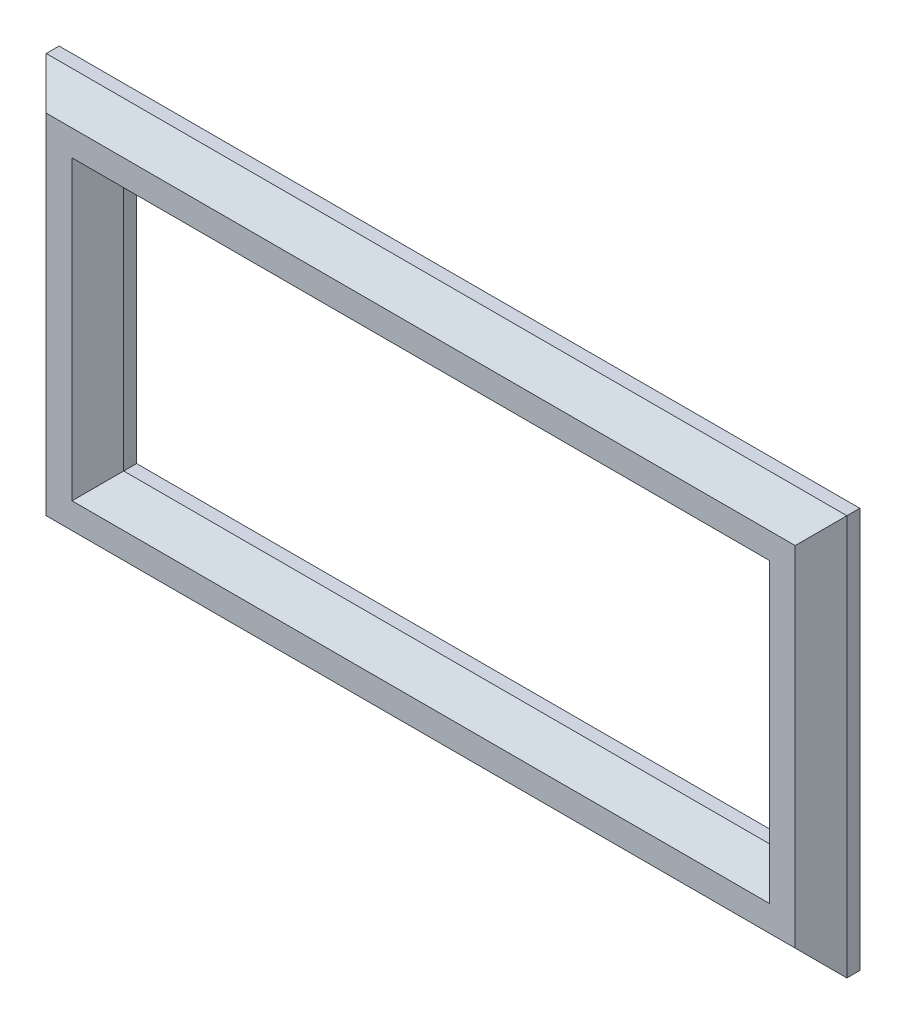
ISO-10303-21;
HEADER;
FILE_DESCRIPTION(('STEP AP214'),'2;1');
FILE_NAME('part.step','',(''),(''),'','','');
FILE_SCHEMA(('AUTOMOTIVE_DESIGN { 1 0 10303 214 1 1 1 1 }'));
ENDSEC;
DATA;
#1=APPLICATION_CONTEXT('core data for automotive mechanical design processes');
#2=APPLICATION_PROTOCOL_DEFINITION('international standard','automotive_design',2000,#1);
#3=PRODUCT_CONTEXT('',#1,'mechanical');
#4=PRODUCT('Part','Part','',(#3));
#5=PRODUCT_RELATED_PRODUCT_CATEGORY('part','',(#4));
#6=PRODUCT_DEFINITION_FORMATION('','',#4);
#7=PRODUCT_DEFINITION_CONTEXT('part definition',#1,'design');
#8=PRODUCT_DEFINITION('design','',#6,#7);
#9=PRODUCT_DEFINITION_SHAPE('','',#8);
#10=(LENGTH_UNIT() NAMED_UNIT(*) SI_UNIT(.MILLI.,.METRE.));
#11=(NAMED_UNIT(*) PLANE_ANGLE_UNIT() SI_UNIT($,.RADIAN.));
#12=(NAMED_UNIT(*) SI_UNIT($,.STERADIAN.) SOLID_ANGLE_UNIT());
#13=UNCERTAINTY_MEASURE_WITH_UNIT(LENGTH_MEASURE(1.E-05),#10,'distance_accuracy_value','');
#14=(GEOMETRIC_REPRESENTATION_CONTEXT(3) GLOBAL_UNCERTAINTY_ASSIGNED_CONTEXT((#13)) GLOBAL_UNIT_ASSIGNED_CONTEXT((#10,
#11,#12)) REPRESENTATION_CONTEXT('',''));
#15=CARTESIAN_POINT('',(0.,0.,0.));
#16=DIRECTION('',(0.,0.,1.));
#17=DIRECTION('',(1.,0.,0.));
#18=AXIS2_PLACEMENT_3D('',#15,#16,#17);
#19=CARTESIAN_POINT('',(0.,0.,3.));
#20=DIRECTION('',(0.,0.,1.));
#21=DIRECTION('',(1.,0.,0.));
#22=AXIS2_PLACEMENT_3D('',#19,#20,#21);
#23=PLANE('',#22);
#24=DIRECTION('',(-1.,0.,0.));
#25=VECTOR('',#24,1.);
#26=CARTESIAN_POINT('',(0.,-1.99999999999999,3.));
#27=LINE('',#26,#25);
#28=CARTESIAN_POINT('',(1.99999999999999,-1.99999999999999,3.));
#29=VERTEX_POINT('',#28);
#30=CARTESIAN_POINT('',(-52.,-2.,3.));
#31=VERTEX_POINT('',#30);
#32=EDGE_CURVE('E197',#29,#31,#27,.T.);
#33=ORIENTED_EDGE('',*,*,#32,.T.);
#34=DIRECTION('',(0.,1.,0.));
#35=VECTOR('',#34,1.);
#36=CARTESIAN_POINT('',(-52.,0.,3.));
#37=LINE('',#36,#35);
#38=CARTESIAN_POINT('',(-52.,21.,3.));
#39=VERTEX_POINT('',#38);
#40=EDGE_CURVE('E199',#31,#39,#37,.T.);
#41=ORIENTED_EDGE('',*,*,#40,.T.);
#42=DIRECTION('',(1.,0.,0.));
#43=VECTOR('',#42,1.);
#44=CARTESIAN_POINT('',(0.,21.,3.));
#45=LINE('',#44,#43);
#46=CARTESIAN_POINT('',(1.99999999999999,21.,3.));
#47=VERTEX_POINT('',#46);
#48=EDGE_CURVE('E193',#39,#47,#45,.T.);
#49=ORIENTED_EDGE('',*,*,#48,.T.);
#50=DIRECTION('',(0.,-1.,0.));
#51=VECTOR('',#50,1.);
#52=CARTESIAN_POINT('',(1.99999999999999,0.,3.));
#53=LINE('',#52,#51);
#54=EDGE_CURVE('E195',#47,#29,#53,.T.);
#55=ORIENTED_EDGE('',*,*,#54,.T.);
#56=EDGE_LOOP('',(#33,#41,#49,#55));
#57=FACE_BOUND('',#56,.T.);
#58=DIRECTION('',(0.,-1.,0.));
#59=VECTOR('',#58,1.);
#60=CARTESIAN_POINT('',(-54.,-6.,3.));
#61=LINE('',#60,#59);
#62=CARTESIAN_POINT('',(-54.,23.,3.));
#63=VERTEX_POINT('',#62);
#64=CARTESIAN_POINT('',(-54.,-4.,3.));
#65=VERTEX_POINT('',#64);
#66=EDGE_CURVE('E188',#63,#65,#61,.T.);
#67=ORIENTED_EDGE('',*,*,#66,.T.);
#68=DIRECTION('',(1.,0.,0.));
#69=VECTOR('',#68,1.);
#70=CARTESIAN_POINT('',(6.,-4.,3.));
#71=LINE('',#70,#69);
#72=CARTESIAN_POINT('',(4.,-4.,3.));
#73=VERTEX_POINT('',#72);
#74=EDGE_CURVE('E190',#65,#73,#71,.T.);
#75=ORIENTED_EDGE('',*,*,#74,.T.);
#76=DIRECTION('',(0.,1.,0.));
#77=VECTOR('',#76,1.);
#78=CARTESIAN_POINT('',(4.,25.,3.));
#79=LINE('',#78,#77);
#80=CARTESIAN_POINT('',(4.,23.,3.));
#81=VERTEX_POINT('',#80);
#82=EDGE_CURVE('E184',#73,#81,#79,.T.);
#83=ORIENTED_EDGE('',*,*,#82,.T.);
#84=DIRECTION('',(-1.,0.,0.));
#85=VECTOR('',#84,1.);
#86=CARTESIAN_POINT('',(-56.,23.,3.));
#87=LINE('',#86,#85);
#88=EDGE_CURVE('E186',#81,#63,#87,.T.);
#89=ORIENTED_EDGE('',*,*,#88,.T.);
#90=EDGE_LOOP('',(#67,#75,#83,#89));
#91=FACE_BOUND('',#90,.T.);
#92=ADVANCED_FACE('F33',(#57,#91),#23,.T.);
#93=CARTESIAN_POINT('',(0.,0.,0.));
#94=DIRECTION('',(0.,0.,1.));
#95=DIRECTION('',(1.,0.,0.));
#96=AXIS2_PLACEMENT_3D('',#93,#94,#95);
#97=PLANE('',#96);
#98=DIRECTION('',(0.,1.,0.));
#99=VECTOR('',#98,1.);
#100=CARTESIAN_POINT('',(6.,-6.,0.));
#101=LINE('',#100,#99);
#102=CARTESIAN_POINT('',(6.,-6.,0.));
#103=VERTEX_POINT('',#102);
#104=CARTESIAN_POINT('',(6.,25.,0.));
#105=VERTEX_POINT('',#104);
#106=EDGE_CURVE('E134',#103,#105,#101,.T.);
#107=ORIENTED_EDGE('',*,*,#106,.F.);
#108=DIRECTION('',(1.,0.,0.));
#109=VECTOR('',#108,1.);
#110=CARTESIAN_POINT('',(6.,-6.,0.));
#111=LINE('',#110,#109);
#112=CARTESIAN_POINT('',(-56.,-6.,0.));
#113=VERTEX_POINT('',#112);
#114=EDGE_CURVE('E170',#113,#103,#111,.T.);
#115=ORIENTED_EDGE('',*,*,#114,.F.);
#116=DIRECTION('',(0.,-1.,0.));
#117=VECTOR('',#116,1.);
#118=CARTESIAN_POINT('',(-56.,-6.,0.));
#119=LINE('',#118,#117);
#120=CARTESIAN_POINT('',(-56.,25.,0.));
#121=VERTEX_POINT('',#120);
#122=EDGE_CURVE('E167',#121,#113,#119,.T.);
#123=ORIENTED_EDGE('',*,*,#122,.F.);
#124=DIRECTION('',(-1.,0.,0.));
#125=VECTOR('',#124,1.);
#126=CARTESIAN_POINT('',(6.,25.,0.));
#127=LINE('',#126,#125);
#128=EDGE_CURVE('E164',#105,#121,#127,.T.);
#129=ORIENTED_EDGE('',*,*,#128,.F.);
#130=EDGE_LOOP('',(#107,#115,#123,#129));
#131=FACE_BOUND('',#130,.T.);
#132=DIRECTION('',(0.,1.,0.));
#133=VECTOR('',#132,1.);
#134=CARTESIAN_POINT('',(0.,0.,0.));
#135=LINE('',#134,#133);
#136=CARTESIAN_POINT('',(0.,0.,0.));
#137=VERTEX_POINT('',#136);
#138=CARTESIAN_POINT('',(0.,19.,0.));
#139=VERTEX_POINT('',#138);
#140=EDGE_CURVE('E128',#137,#139,#135,.T.);
#141=ORIENTED_EDGE('',*,*,#140,.T.);
#142=DIRECTION('',(-1.,0.,0.));
#143=VECTOR('',#142,1.);
#144=CARTESIAN_POINT('',(0.,19.,0.));
#145=LINE('',#144,#143);
#146=CARTESIAN_POINT('',(-50.,19.,0.));
#147=VERTEX_POINT('',#146);
#148=EDGE_CURVE('E138',#139,#147,#145,.T.);
#149=ORIENTED_EDGE('',*,*,#148,.T.);
#150=DIRECTION('',(0.,-1.,0.));
#151=VECTOR('',#150,1.);
#152=CARTESIAN_POINT('',(-50.,0.,0.));
#153=LINE('',#152,#151);
#154=CARTESIAN_POINT('',(-50.,0.,0.));
#155=VERTEX_POINT('',#154);
#156=EDGE_CURVE('E144',#147,#155,#153,.T.);
#157=ORIENTED_EDGE('',*,*,#156,.T.);
#158=DIRECTION('',(1.,0.,0.));
#159=VECTOR('',#158,1.);
#160=CARTESIAN_POINT('',(0.,0.,0.));
#161=LINE('',#160,#159);
#162=EDGE_CURVE('E148',#155,#137,#161,.T.);
#163=ORIENTED_EDGE('',*,*,#162,.T.);
#164=EDGE_LOOP('',(#141,#149,#157,#163));
#165=FACE_BOUND('',#164,.T.);
#166=ADVANCED_FACE('F146',(#131,#165),#97,.F.);
#167=CARTESIAN_POINT('',(6.,-6.,3.));
#168=DIRECTION('',(-1.,0.,0.));
#169=DIRECTION('',(0.,0.,1.));
#170=AXIS2_PLACEMENT_3D('',#167,#168,#169);
#171=PLANE('',#170);
#172=DIRECTION('',(0.,0.,-1.));
#173=VECTOR('',#172,1.);
#174=CARTESIAN_POINT('',(6.,25.,3.));
#175=LINE('',#174,#173);
#176=CARTESIAN_POINT('',(6.,25.,0.999999999999998));
#177=VERTEX_POINT('',#176);
#178=EDGE_CURVE('E179',#177,#105,#175,.T.);
#179=ORIENTED_EDGE('',*,*,#178,.F.);
#180=DIRECTION('',(0.,-1.,0.));
#181=VECTOR('',#180,1.);
#182=CARTESIAN_POINT('',(6.,-6.,0.999999999999998));
#183=LINE('',#182,#181);
#184=CARTESIAN_POINT('',(6.,-6.,0.999999999999998));
#185=VERTEX_POINT('',#184);
#186=EDGE_CURVE('E11',#177,#185,#183,.T.);
#187=ORIENTED_EDGE('',*,*,#186,.T.);
#188=DIRECTION('',(0.,0.,-1.));
#189=VECTOR('',#188,1.);
#190=CARTESIAN_POINT('',(6.,-6.,3.));
#191=LINE('',#190,#189);
#192=EDGE_CURVE('E173',#185,#103,#191,.T.);
#193=ORIENTED_EDGE('',*,*,#192,.T.);
#194=ORIENTED_EDGE('',*,*,#106,.T.);
#195=EDGE_LOOP('',(#179,#187,#193,#194));
#196=FACE_BOUND('',#195,.T.);
#197=ADVANCED_FACE('F239',(#196),#171,.F.);
#198=CARTESIAN_POINT('',(6.,25.,3.));
#199=DIRECTION('',(0.,-1.,0.));
#200=DIRECTION('',(0.,0.,-1.));
#201=AXIS2_PLACEMENT_3D('',#198,#199,#200);
#202=PLANE('',#201);
#203=DIRECTION('',(0.,0.,-1.));
#204=VECTOR('',#203,1.);
#205=CARTESIAN_POINT('',(-56.,25.,3.));
#206=LINE('',#205,#204);
#207=CARTESIAN_POINT('',(-56.,25.,0.999999999999998));
#208=VERTEX_POINT('',#207);
#209=EDGE_CURVE('E177',#208,#121,#206,.T.);
#210=ORIENTED_EDGE('',*,*,#209,.F.);
#211=DIRECTION('',(1.,0.,0.));
#212=VECTOR('',#211,1.);
#213=CARTESIAN_POINT('',(6.,25.,0.999999999999998));
#214=LINE('',#213,#212);
#215=EDGE_CURVE('E42',#208,#177,#214,.T.);
#216=ORIENTED_EDGE('',*,*,#215,.T.);
#217=ORIENTED_EDGE('',*,*,#178,.T.);
#218=ORIENTED_EDGE('',*,*,#128,.T.);
#219=EDGE_LOOP('',(#210,#216,#217,#218));
#220=FACE_BOUND('',#219,.T.);
#221=ADVANCED_FACE('F265',(#220),#202,.F.);
#222=CARTESIAN_POINT('',(-56.,-6.,3.));
#223=DIRECTION('',(1.,0.,0.));
#224=DIRECTION('',(0.,0.,-1.));
#225=AXIS2_PLACEMENT_3D('',#222,#223,#224);
#226=PLANE('',#225);
#227=DIRECTION('',(0.,0.,-1.));
#228=VECTOR('',#227,1.);
#229=CARTESIAN_POINT('',(-56.,-6.,3.));
#230=LINE('',#229,#228);
#231=CARTESIAN_POINT('',(-56.,-6.,0.999999999999998));
#232=VERTEX_POINT('',#231);
#233=EDGE_CURVE('E175',#232,#113,#230,.T.);
#234=ORIENTED_EDGE('',*,*,#233,.F.);
#235=DIRECTION('',(0.,1.,0.));
#236=VECTOR('',#235,1.);
#237=CARTESIAN_POINT('',(-56.,25.,0.999999999999998));
#238=LINE('',#237,#236);
#239=EDGE_CURVE('E57',#232,#208,#238,.T.);
#240=ORIENTED_EDGE('',*,*,#239,.T.);
#241=ORIENTED_EDGE('',*,*,#209,.T.);
#242=ORIENTED_EDGE('',*,*,#122,.T.);
#243=EDGE_LOOP('',(#234,#240,#241,#242));
#244=FACE_BOUND('',#243,.T.);
#245=ADVANCED_FACE('F262',(#244),#226,.F.);
#246=CARTESIAN_POINT('',(6.,-6.,3.));
#247=DIRECTION('',(0.,1.,0.));
#248=DIRECTION('',(0.,0.,1.));
#249=AXIS2_PLACEMENT_3D('',#246,#247,#248);
#250=PLANE('',#249);
#251=ORIENTED_EDGE('',*,*,#192,.F.);
#252=DIRECTION('',(-1.,0.,0.));
#253=VECTOR('',#252,1.);
#254=CARTESIAN_POINT('',(-56.,-6.,0.999999999999998));
#255=LINE('',#254,#253);
#256=EDGE_CURVE('E207',#185,#232,#255,.T.);
#257=ORIENTED_EDGE('',*,*,#256,.T.);
#258=ORIENTED_EDGE('',*,*,#233,.T.);
#259=ORIENTED_EDGE('',*,*,#114,.T.);
#260=EDGE_LOOP('',(#251,#257,#258,#259));
#261=FACE_BOUND('',#260,.T.);
#262=ADVANCED_FACE('F242',(#261),#250,.F.);
#263=CARTESIAN_POINT('',(0.,0.,3.));
#264=DIRECTION('',(-1.,0.,0.));
#265=DIRECTION('',(0.,0.,1.));
#266=AXIS2_PLACEMENT_3D('',#263,#264,#265);
#267=PLANE('',#266);
#268=DIRECTION('',(0.,0.,-1.));
#269=VECTOR('',#268,1.);
#270=CARTESIAN_POINT('',(0.,0.,3.));
#271=LINE('',#270,#269);
#272=CARTESIAN_POINT('',(0.,0.,1.00000000000001));
#273=VERTEX_POINT('',#272);
#274=EDGE_CURVE('E157',#273,#137,#271,.T.);
#275=ORIENTED_EDGE('',*,*,#274,.F.);
#276=DIRECTION('',(0.,1.,0.));
#277=VECTOR('',#276,1.);
#278=CARTESIAN_POINT('',(0.,0.,1.00000000000001));
#279=LINE('',#278,#277);
#280=CARTESIAN_POINT('',(0.,19.,1.00000000000001));
#281=VERTEX_POINT('',#280);
#282=EDGE_CURVE('E131',#273,#281,#279,.T.);
#283=ORIENTED_EDGE('',*,*,#282,.T.);
#284=DIRECTION('',(0.,0.,-1.));
#285=VECTOR('',#284,1.);
#286=CARTESIAN_POINT('',(0.,19.,3.));
#287=LINE('',#286,#285);
#288=EDGE_CURVE('E123',#281,#139,#287,.T.);
#289=ORIENTED_EDGE('',*,*,#288,.T.);
#290=ORIENTED_EDGE('',*,*,#140,.F.);
#291=EDGE_LOOP('',(#275,#283,#289,#290));
#292=FACE_BOUND('',#291,.T.);
#293=ADVANCED_FACE('F126',(#292),#267,.T.);
#294=CARTESIAN_POINT('',(0.,19.,3.));
#295=DIRECTION('',(0.,-1.,0.));
#296=DIRECTION('',(1.,0.,0.));
#297=AXIS2_PLACEMENT_3D('',#294,#295,#296);
#298=PLANE('',#297);
#299=ORIENTED_EDGE('',*,*,#288,.F.);
#300=DIRECTION('',(-1.,0.,0.));
#301=VECTOR('',#300,1.);
#302=CARTESIAN_POINT('',(0.,19.,1.00000000000001));
#303=LINE('',#302,#301);
#304=CARTESIAN_POINT('',(-50.,19.,1.00000000000001));
#305=VERTEX_POINT('',#304);
#306=EDGE_CURVE('E205',#281,#305,#303,.T.);
#307=ORIENTED_EDGE('',*,*,#306,.T.);
#308=DIRECTION('',(0.,0.,-1.));
#309=VECTOR('',#308,1.);
#310=CARTESIAN_POINT('',(-50.,19.,3.));
#311=LINE('',#310,#309);
#312=EDGE_CURVE('E135',#305,#147,#311,.T.);
#313=ORIENTED_EDGE('',*,*,#312,.T.);
#314=ORIENTED_EDGE('',*,*,#148,.F.);
#315=EDGE_LOOP('',(#299,#307,#313,#314));
#316=FACE_BOUND('',#315,.T.);
#317=ADVANCED_FACE('F139',(#316),#298,.T.);
#318=CARTESIAN_POINT('',(-50.,0.,3.));
#319=DIRECTION('',(1.,0.,0.));
#320=DIRECTION('',(0.,0.,-1.));
#321=AXIS2_PLACEMENT_3D('',#318,#319,#320);
#322=PLANE('',#321);
#323=ORIENTED_EDGE('',*,*,#312,.F.);
#324=DIRECTION('',(0.,-1.,0.));
#325=VECTOR('',#324,1.);
#326=CARTESIAN_POINT('',(-50.,0.,1.00000000000001));
#327=LINE('',#326,#325);
#328=CARTESIAN_POINT('',(-50.,0.,1.00000000000001));
#329=VERTEX_POINT('',#328);
#330=EDGE_CURVE('E181',#305,#329,#327,.T.);
#331=ORIENTED_EDGE('',*,*,#330,.T.);
#332=DIRECTION('',(0.,0.,-1.));
#333=VECTOR('',#332,1.);
#334=CARTESIAN_POINT('',(-50.,0.,3.));
#335=LINE('',#334,#333);
#336=EDGE_CURVE('E159',#329,#155,#335,.T.);
#337=ORIENTED_EDGE('',*,*,#336,.T.);
#338=ORIENTED_EDGE('',*,*,#156,.F.);
#339=EDGE_LOOP('',(#323,#331,#337,#338));
#340=FACE_BOUND('',#339,.T.);
#341=ADVANCED_FACE('F318',(#340),#322,.T.);
#342=CARTESIAN_POINT('',(0.,0.,3.));
#343=DIRECTION('',(0.,1.,0.));
#344=DIRECTION('',(-1.,0.,0.));
#345=AXIS2_PLACEMENT_3D('',#342,#343,#344);
#346=PLANE('',#345);
#347=ORIENTED_EDGE('',*,*,#336,.F.);
#348=DIRECTION('',(1.,0.,0.));
#349=VECTOR('',#348,1.);
#350=CARTESIAN_POINT('',(0.,0.,1.00000000000001));
#351=LINE('',#350,#349);
#352=EDGE_CURVE('E202',#329,#273,#351,.T.);
#353=ORIENTED_EDGE('',*,*,#352,.T.);
#354=ORIENTED_EDGE('',*,*,#274,.T.);
#355=ORIENTED_EDGE('',*,*,#162,.F.);
#356=EDGE_LOOP('',(#347,#353,#354,#355));
#357=FACE_BOUND('',#356,.T.);
#358=ADVANCED_FACE('F285',(#357),#346,.T.);
#359=CARTESIAN_POINT('',(0.,0.,1.00000000000001));
#360=DIRECTION('',(0.707106781186548,0.,-0.707106781186548));
#361=DIRECTION('',(0.,1.,0.));
#362=AXIS2_PLACEMENT_3D('',#359,#360,#361);
#363=PLANE('',#362);
#364=DIRECTION('',(0.577350269189626,-0.577350269189626,0.577350269189626));
#365=VECTOR('',#364,1.);
#366=CARTESIAN_POINT('',(0.,0.,1.00000000000001));
#367=LINE('',#366,#365);
#368=EDGE_CURVE('E152',#29,#273,#367,.F.);
#369=ORIENTED_EDGE('',*,*,#368,.F.);
#370=ORIENTED_EDGE('',*,*,#54,.F.);
#371=DIRECTION('',(0.577350269189626,0.577350269189626,0.577350269189626));
#372=VECTOR('',#371,1.);
#373=CARTESIAN_POINT('',(-6.33333333333333,12.6666666666667,-5.33333333333333));
#374=LINE('',#373,#372);
#375=EDGE_CURVE('E149',#281,#47,#374,.T.);
#376=ORIENTED_EDGE('',*,*,#375,.F.);
#377=ORIENTED_EDGE('',*,*,#282,.F.);
#378=EDGE_LOOP('',(#369,#370,#376,#377));
#379=FACE_BOUND('',#378,.T.);
#380=ADVANCED_FACE('F281',(#379),#363,.F.);
#381=CARTESIAN_POINT('',(0.,19.,1.00000000000001));
#382=DIRECTION('',(0.,0.707106781186548,-0.707106781186548));
#383=DIRECTION('',(-1.,0.,0.));
#384=AXIS2_PLACEMENT_3D('',#381,#382,#383);
#385=PLANE('',#384);
#386=ORIENTED_EDGE('',*,*,#375,.T.);
#387=ORIENTED_EDGE('',*,*,#48,.F.);
#388=DIRECTION('',(0.577350269189626,-0.577350269189626,-0.577350269189626));
#389=VECTOR('',#388,1.);
#390=CARTESIAN_POINT('',(-43.6666666666667,12.6666666666667,-5.33333333333333));
#391=LINE('',#390,#389);
#392=EDGE_CURVE('E214',#305,#39,#391,.F.);
#393=ORIENTED_EDGE('',*,*,#392,.F.);
#394=ORIENTED_EDGE('',*,*,#306,.F.);
#395=EDGE_LOOP('',(#386,#387,#393,#394));
#396=FACE_BOUND('',#395,.T.);
#397=ADVANCED_FACE('F277',(#396),#385,.F.);
#398=CARTESIAN_POINT('',(0.,0.,1.00000000000001));
#399=DIRECTION('',(0.,-0.707106781186548,-0.707106781186548));
#400=DIRECTION('',(1.,0.,0.));
#401=AXIS2_PLACEMENT_3D('',#398,#399,#400);
#402=PLANE('',#401);
#403=ORIENTED_EDGE('',*,*,#368,.T.);
#404=ORIENTED_EDGE('',*,*,#352,.F.);
#405=DIRECTION('',(-0.577350269189626,-0.577350269189626,0.577350269189626));
#406=VECTOR('',#405,1.);
#407=CARTESIAN_POINT('',(-50.,0.,1.00000000000001));
#408=LINE('',#407,#406);
#409=EDGE_CURVE('E212',#31,#329,#408,.F.);
#410=ORIENTED_EDGE('',*,*,#409,.F.);
#411=ORIENTED_EDGE('',*,*,#32,.F.);
#412=EDGE_LOOP('',(#403,#404,#410,#411));
#413=FACE_BOUND('',#412,.T.);
#414=ADVANCED_FACE('F273',(#413),#402,.F.);
#415=CARTESIAN_POINT('',(-50.,0.,1.00000000000001));
#416=DIRECTION('',(-0.707106781186548,0.,-0.707106781186548));
#417=DIRECTION('',(0.,-1.,0.));
#418=AXIS2_PLACEMENT_3D('',#415,#416,#417);
#419=PLANE('',#418);
#420=ORIENTED_EDGE('',*,*,#392,.T.);
#421=ORIENTED_EDGE('',*,*,#40,.F.);
#422=ORIENTED_EDGE('',*,*,#409,.T.);
#423=ORIENTED_EDGE('',*,*,#330,.F.);
#424=EDGE_LOOP('',(#420,#421,#422,#423));
#425=FACE_BOUND('',#424,.T.);
#426=ADVANCED_FACE('F270',(#425),#419,.F.);
#427=CARTESIAN_POINT('',(0.,23.,3.));
#428=DIRECTION('',(0.,0.707106781186547,0.707106781186547));
#429=DIRECTION('',(1.,0.,0.));
#430=AXIS2_PLACEMENT_3D('',#427,#428,#429);
#431=PLANE('',#430);
#432=DIRECTION('',(-0.577350269189626,-0.577350269189626,0.577350269189626));
#433=VECTOR('',#432,1.);
#434=CARTESIAN_POINT('',(-3.66666666666667,15.3333333333333,10.6666666666667));
#435=LINE('',#434,#433);
#436=EDGE_CURVE('E221',#177,#81,#435,.T.);
#437=ORIENTED_EDGE('',*,*,#436,.F.);
#438=ORIENTED_EDGE('',*,*,#215,.F.);
#439=DIRECTION('',(0.577350269189626,-0.577350269189626,0.577350269189626));
#440=VECTOR('',#439,1.);
#441=CARTESIAN_POINT('',(-36.,5.,21.));
#442=LINE('',#441,#440);
#443=EDGE_CURVE('E37',#63,#208,#442,.F.);
#444=ORIENTED_EDGE('',*,*,#443,.F.);
#445=ORIENTED_EDGE('',*,*,#88,.F.);
#446=EDGE_LOOP('',(#437,#438,#444,#445));
#447=FACE_BOUND('',#446,.T.);
#448=ADVANCED_FACE('F35',(#447),#431,.T.);
#449=CARTESIAN_POINT('',(-54.,0.,3.));
#450=DIRECTION('',(-0.707106781186547,0.,0.707106781186547));
#451=DIRECTION('',(0.,1.,0.));
#452=AXIS2_PLACEMENT_3D('',#449,#450,#451);
#453=PLANE('',#452);
#454=ORIENTED_EDGE('',*,*,#443,.T.);
#455=ORIENTED_EDGE('',*,*,#239,.F.);
#456=DIRECTION('',(0.577350269189626,0.577350269189626,0.577350269189626));
#457=VECTOR('',#456,1.);
#458=CARTESIAN_POINT('',(-52.6666666666667,-2.66666666666667,4.33333333333333));
#459=LINE('',#458,#457);
#460=EDGE_CURVE('E220',#65,#232,#459,.F.);
#461=ORIENTED_EDGE('',*,*,#460,.F.);
#462=ORIENTED_EDGE('',*,*,#66,.F.);
#463=EDGE_LOOP('',(#454,#455,#461,#462));
#464=FACE_BOUND('',#463,.T.);
#465=ADVANCED_FACE('F231',(#464),#453,.T.);
#466=CARTESIAN_POINT('',(4.,0.,3.));
#467=DIRECTION('',(0.707106781186547,0.,0.707106781186547));
#468=DIRECTION('',(0.,-1.,0.));
#469=AXIS2_PLACEMENT_3D('',#466,#467,#468);
#470=PLANE('',#469);
#471=ORIENTED_EDGE('',*,*,#436,.T.);
#472=ORIENTED_EDGE('',*,*,#82,.F.);
#473=DIRECTION('',(0.577350269189626,-0.577350269189626,-0.577350269189626));
#474=VECTOR('',#473,1.);
#475=CARTESIAN_POINT('',(2.66666666666667,-2.66666666666667,4.33333333333333));
#476=LINE('',#475,#474);
#477=EDGE_CURVE('E218',#185,#73,#476,.F.);
#478=ORIENTED_EDGE('',*,*,#477,.F.);
#479=ORIENTED_EDGE('',*,*,#186,.F.);
#480=EDGE_LOOP('',(#471,#472,#478,#479));
#481=FACE_BOUND('',#480,.T.);
#482=ADVANCED_FACE('F236',(#481),#470,.T.);
#483=CARTESIAN_POINT('',(0.,-4.,3.));
#484=DIRECTION('',(0.,-0.707106781186547,0.707106781186547));
#485=DIRECTION('',(-1.,0.,0.));
#486=AXIS2_PLACEMENT_3D('',#483,#484,#485);
#487=PLANE('',#486);
#488=ORIENTED_EDGE('',*,*,#460,.T.);
#489=ORIENTED_EDGE('',*,*,#256,.F.);
#490=ORIENTED_EDGE('',*,*,#477,.T.);
#491=ORIENTED_EDGE('',*,*,#74,.F.);
#492=EDGE_LOOP('',(#488,#489,#490,#491));
#493=FACE_BOUND('',#492,.T.);
#494=ADVANCED_FACE('F246',(#493),#487,.T.);
#495=CLOSED_SHELL('',(#92,#166,#197,#221,#245,#262,#293,#317,#341,#358,#380,#397,#414,#426,#448,
#465,#482,#494));
#496=MANIFOLD_SOLID_BREP('B2',#495);
#497=ADVANCED_BREP_SHAPE_REPRESENTATION('',(#18,#496),#14);
#498=SHAPE_DEFINITION_REPRESENTATION(#9,#497);
ENDSEC;
END-ISO-10303-21;
